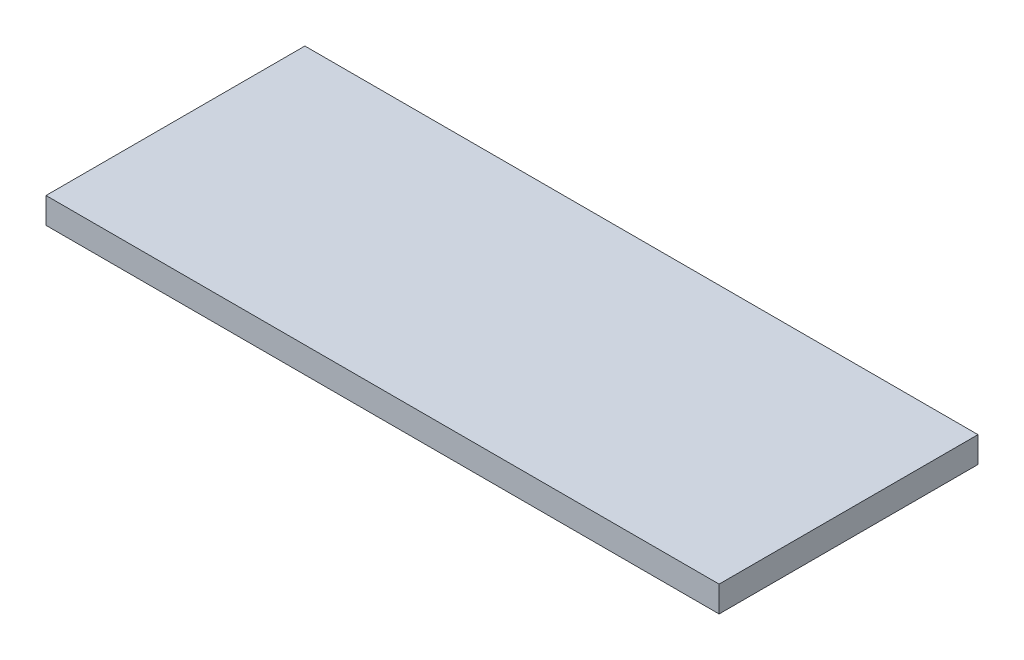
ISO-10303-21;
HEADER;
FILE_DESCRIPTION(('STEP AP214'),'2;1');
FILE_NAME('part.step','',(''),(''),'','','');
FILE_SCHEMA(('AUTOMOTIVE_DESIGN { 1 0 10303 214 1 1 1 1 }'));
ENDSEC;
DATA;
#1=APPLICATION_CONTEXT('core data for automotive mechanical design processes');
#2=APPLICATION_PROTOCOL_DEFINITION('international standard','automotive_design',2000,#1);
#3=PRODUCT_CONTEXT('',#1,'mechanical');
#4=PRODUCT('Part','Part','',(#3));
#5=PRODUCT_RELATED_PRODUCT_CATEGORY('part','',(#4));
#6=PRODUCT_DEFINITION_FORMATION('','',#4);
#7=PRODUCT_DEFINITION_CONTEXT('part definition',#1,'design');
#8=PRODUCT_DEFINITION('design','',#6,#7);
#9=PRODUCT_DEFINITION_SHAPE('','',#8);
#10=(LENGTH_UNIT() NAMED_UNIT(*) SI_UNIT(.MILLI.,.METRE.));
#11=(NAMED_UNIT(*) PLANE_ANGLE_UNIT() SI_UNIT($,.RADIAN.));
#12=(NAMED_UNIT(*) SI_UNIT($,.STERADIAN.) SOLID_ANGLE_UNIT());
#13=UNCERTAINTY_MEASURE_WITH_UNIT(LENGTH_MEASURE(1.E-05),#10,'distance_accuracy_value','');
#14=(GEOMETRIC_REPRESENTATION_CONTEXT(3) GLOBAL_UNCERTAINTY_ASSIGNED_CONTEXT((#13)) GLOBAL_UNIT_ASSIGNED_CONTEXT((#10,
#11,#12)) REPRESENTATION_CONTEXT('',''));
#15=CARTESIAN_POINT('',(0.,0.,0.));
#16=DIRECTION('',(0.,0.,1.));
#17=DIRECTION('',(1.,0.,0.));
#18=AXIS2_PLACEMENT_3D('',#15,#16,#17);
#19=CARTESIAN_POINT('',(-130.,10.,-50.));
#20=DIRECTION('',(1.,0.,0.));
#21=DIRECTION('',(0.,0.,-1.));
#22=AXIS2_PLACEMENT_3D('',#19,#20,#21);
#23=PLANE('',#22);
#24=DIRECTION('',(0.,0.,1.));
#25=VECTOR('',#24,1.);
#26=CARTESIAN_POINT('',(-130.,0.,-50.));
#27=LINE('',#26,#25);
#28=CARTESIAN_POINT('',(-130.,0.,-50.));
#29=VERTEX_POINT('',#28);
#30=CARTESIAN_POINT('',(-130.,0.,50.));
#31=VERTEX_POINT('',#30);
#32=EDGE_CURVE('E96',#29,#31,#27,.T.);
#33=ORIENTED_EDGE('',*,*,#32,.T.);
#34=DIRECTION('',(0.,-1.,0.));
#35=VECTOR('',#34,1.);
#36=CARTESIAN_POINT('',(-130.,10.,50.));
#37=LINE('',#36,#35);
#38=CARTESIAN_POINT('',(-130.,10.,50.));
#39=VERTEX_POINT('',#38);
#40=EDGE_CURVE('E11',#39,#31,#37,.T.);
#41=ORIENTED_EDGE('',*,*,#40,.F.);
#42=DIRECTION('',(0.,0.,1.));
#43=VECTOR('',#42,1.);
#44=CARTESIAN_POINT('',(-130.,10.,-50.));
#45=LINE('',#44,#43);
#46=CARTESIAN_POINT('',(-130.,10.,-50.));
#47=VERTEX_POINT('',#46);
#48=EDGE_CURVE('E84',#47,#39,#45,.T.);
#49=ORIENTED_EDGE('',*,*,#48,.F.);
#50=DIRECTION('',(0.,-1.,0.));
#51=VECTOR('',#50,1.);
#52=CARTESIAN_POINT('',(-130.,10.,-50.));
#53=LINE('',#52,#51);
#54=EDGE_CURVE('E92',#47,#29,#53,.T.);
#55=ORIENTED_EDGE('',*,*,#54,.T.);
#56=EDGE_LOOP('',(#33,#41,#49,#55));
#57=FACE_BOUND('',#56,.T.);
#58=ADVANCED_FACE('F33',(#57),#23,.F.);
#59=CARTESIAN_POINT('',(-130.,10.,50.));
#60=DIRECTION('',(0.,0.,-1.));
#61=DIRECTION('',(-1.,0.,0.));
#62=AXIS2_PLACEMENT_3D('',#59,#60,#61);
#63=PLANE('',#62);
#64=DIRECTION('',(1.,0.,0.));
#65=VECTOR('',#64,1.);
#66=CARTESIAN_POINT('',(-130.,0.,50.));
#67=LINE('',#66,#65);
#68=CARTESIAN_POINT('',(130.,0.,50.));
#69=VERTEX_POINT('',#68);
#70=EDGE_CURVE('E88',#31,#69,#67,.T.);
#71=ORIENTED_EDGE('',*,*,#70,.T.);
#72=DIRECTION('',(0.,-1.,0.));
#73=VECTOR('',#72,1.);
#74=CARTESIAN_POINT('',(130.,10.,50.));
#75=LINE('',#74,#73);
#76=CARTESIAN_POINT('',(130.,10.,50.));
#77=VERTEX_POINT('',#76);
#78=EDGE_CURVE('E41',#77,#69,#75,.T.);
#79=ORIENTED_EDGE('',*,*,#78,.F.);
#80=DIRECTION('',(1.,0.,0.));
#81=VECTOR('',#80,1.);
#82=CARTESIAN_POINT('',(-130.,10.,50.));
#83=LINE('',#82,#81);
#84=EDGE_CURVE('E79',#39,#77,#83,.T.);
#85=ORIENTED_EDGE('',*,*,#84,.F.);
#86=ORIENTED_EDGE('',*,*,#40,.T.);
#87=EDGE_LOOP('',(#71,#79,#85,#86));
#88=FACE_BOUND('',#87,.T.);
#89=ADVANCED_FACE('F87',(#88),#63,.F.);
#90=CARTESIAN_POINT('',(130.,10.,-50.));
#91=DIRECTION('',(-1.,0.,0.));
#92=DIRECTION('',(0.,0.,1.));
#93=AXIS2_PLACEMENT_3D('',#90,#91,#92);
#94=PLANE('',#93);
#95=DIRECTION('',(0.,0.,-1.));
#96=VECTOR('',#95,1.);
#97=CARTESIAN_POINT('',(130.,0.,-50.));
#98=LINE('',#97,#96);
#99=CARTESIAN_POINT('',(130.,0.,-50.));
#100=VERTEX_POINT('',#99);
#101=EDGE_CURVE('E66',#69,#100,#98,.T.);
#102=ORIENTED_EDGE('',*,*,#101,.T.);
#103=DIRECTION('',(0.,-1.,0.));
#104=VECTOR('',#103,1.);
#105=CARTESIAN_POINT('',(130.,10.,-50.));
#106=LINE('',#105,#104);
#107=CARTESIAN_POINT('',(130.,10.,-50.));
#108=VERTEX_POINT('',#107);
#109=EDGE_CURVE('E89',#108,#100,#106,.T.);
#110=ORIENTED_EDGE('',*,*,#109,.F.);
#111=DIRECTION('',(0.,0.,-1.));
#112=VECTOR('',#111,1.);
#113=CARTESIAN_POINT('',(130.,10.,-50.));
#114=LINE('',#113,#112);
#115=EDGE_CURVE('E82',#77,#108,#114,.T.);
#116=ORIENTED_EDGE('',*,*,#115,.F.);
#117=ORIENTED_EDGE('',*,*,#78,.T.);
#118=EDGE_LOOP('',(#102,#110,#116,#117));
#119=FACE_BOUND('',#118,.T.);
#120=ADVANCED_FACE('F90',(#119),#94,.F.);
#121=CARTESIAN_POINT('',(-130.,10.,-50.));
#122=DIRECTION('',(0.,0.,1.));
#123=DIRECTION('',(1.,0.,0.));
#124=AXIS2_PLACEMENT_3D('',#121,#122,#123);
#125=PLANE('',#124);
#126=DIRECTION('',(-1.,0.,0.));
#127=VECTOR('',#126,1.);
#128=CARTESIAN_POINT('',(-130.,0.,-50.));
#129=LINE('',#128,#127);
#130=EDGE_CURVE('E72',#100,#29,#129,.T.);
#131=ORIENTED_EDGE('',*,*,#130,.T.);
#132=ORIENTED_EDGE('',*,*,#54,.F.);
#133=DIRECTION('',(-1.,0.,0.));
#134=VECTOR('',#133,1.);
#135=CARTESIAN_POINT('',(-130.,10.,-50.));
#136=LINE('',#135,#134);
#137=EDGE_CURVE('E49',#108,#47,#136,.T.);
#138=ORIENTED_EDGE('',*,*,#137,.F.);
#139=ORIENTED_EDGE('',*,*,#109,.T.);
#140=EDGE_LOOP('',(#131,#132,#138,#139));
#141=FACE_BOUND('',#140,.T.);
#142=ADVANCED_FACE('F103',(#141),#125,.F.);
#143=CARTESIAN_POINT('',(0.,10.,0.));
#144=DIRECTION('',(0.,1.,0.));
#145=DIRECTION('',(0.,0.,1.));
#146=AXIS2_PLACEMENT_3D('',#143,#144,#145);
#147=PLANE('',#146);
#148=ORIENTED_EDGE('',*,*,#48,.T.);
#149=ORIENTED_EDGE('',*,*,#84,.T.);
#150=ORIENTED_EDGE('',*,*,#115,.T.);
#151=ORIENTED_EDGE('',*,*,#137,.T.);
#152=EDGE_LOOP('',(#148,#149,#150,#151));
#153=FACE_BOUND('',#152,.T.);
#154=ADVANCED_FACE('F80',(#153),#147,.T.);
#155=CARTESIAN_POINT('',(0.,0.,0.));
#156=DIRECTION('',(0.,1.,0.));
#157=DIRECTION('',(0.,0.,1.));
#158=AXIS2_PLACEMENT_3D('',#155,#156,#157);
#159=PLANE('',#158);
#160=ORIENTED_EDGE('',*,*,#32,.F.);
#161=ORIENTED_EDGE('',*,*,#130,.F.);
#162=ORIENTED_EDGE('',*,*,#101,.F.);
#163=ORIENTED_EDGE('',*,*,#70,.F.);
#164=EDGE_LOOP('',(#160,#161,#162,#163));
#165=FACE_BOUND('',#164,.T.);
#166=ADVANCED_FACE('F106',(#165),#159,.F.);
#167=CLOSED_SHELL('',(#58,#89,#120,#142,#154,#166));
#168=MANIFOLD_SOLID_BREP('B2',#167);
#169=ADVANCED_BREP_SHAPE_REPRESENTATION('',(#18,#168),#14);
#170=SHAPE_DEFINITION_REPRESENTATION(#9,#169);
ENDSEC;
END-ISO-10303-21;
